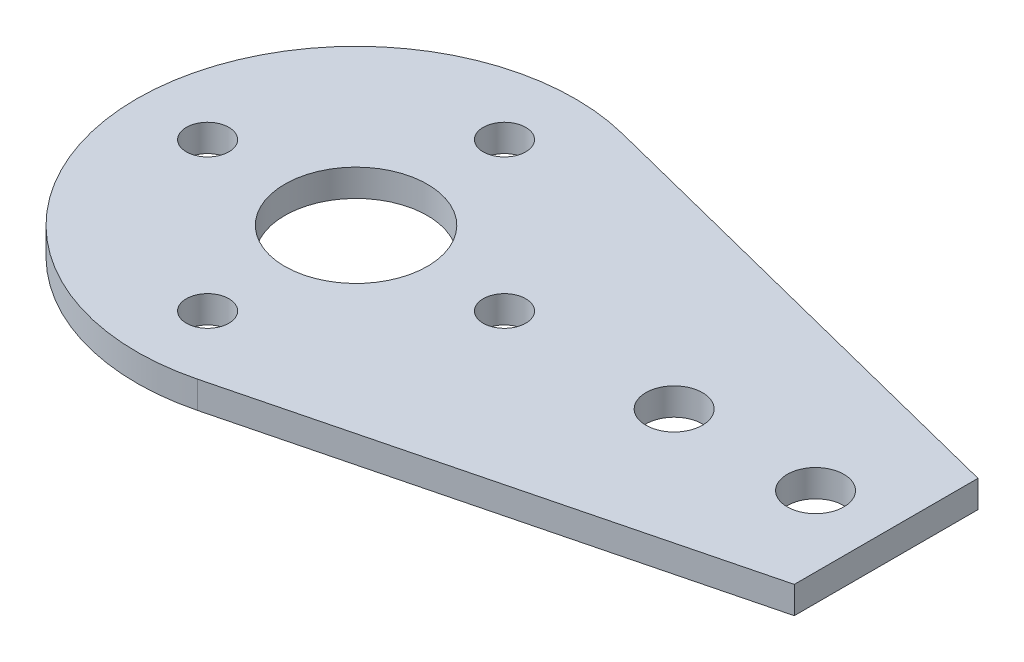
ISO-10303-21;
HEADER;
FILE_DESCRIPTION(('STEP AP214'),'2;1');
FILE_NAME('part.step','',(''),(''),'','','');
FILE_SCHEMA(('AUTOMOTIVE_DESIGN { 1 0 10303 214 1 1 1 1 }'));
ENDSEC;
DATA;
#1=APPLICATION_CONTEXT('core data for automotive mechanical design processes');
#2=APPLICATION_PROTOCOL_DEFINITION('international standard','automotive_design',2000,#1);
#3=PRODUCT_CONTEXT('',#1,'mechanical');
#4=PRODUCT('Part','Part','',(#3));
#5=PRODUCT_RELATED_PRODUCT_CATEGORY('part','',(#4));
#6=PRODUCT_DEFINITION_FORMATION('','',#4);
#7=PRODUCT_DEFINITION_CONTEXT('part definition',#1,'design');
#8=PRODUCT_DEFINITION('design','',#6,#7);
#9=PRODUCT_DEFINITION_SHAPE('','',#8);
#10=(LENGTH_UNIT() NAMED_UNIT(*) SI_UNIT(.MILLI.,.METRE.));
#11=(NAMED_UNIT(*) PLANE_ANGLE_UNIT() SI_UNIT($,.RADIAN.));
#12=(NAMED_UNIT(*) SI_UNIT($,.STERADIAN.) SOLID_ANGLE_UNIT());
#13=UNCERTAINTY_MEASURE_WITH_UNIT(LENGTH_MEASURE(1.E-05),#10,'distance_accuracy_value','');
#14=(GEOMETRIC_REPRESENTATION_CONTEXT(3) GLOBAL_UNCERTAINTY_ASSIGNED_CONTEXT((#13)) GLOBAL_UNIT_ASSIGNED_CONTEXT((#10,
#11,#12)) REPRESENTATION_CONTEXT('',''));
#15=CARTESIAN_POINT('',(0.,0.,0.));
#16=DIRECTION('',(0.,0.,1.));
#17=DIRECTION('',(1.,0.,0.));
#18=AXIS2_PLACEMENT_3D('',#15,#16,#17);
#19=CARTESIAN_POINT('',(0.,1.524,0.));
#20=DIRECTION('',(0.,1.,0.));
#21=DIRECTION('',(0.,0.,1.));
#22=AXIS2_PLACEMENT_3D('',#19,#20,#21);
#23=PLANE('',#22);
#24=CARTESIAN_POINT('',(0.,1.524,8.3312));
#25=DIRECTION('',(0.,1.,0.));
#26=DIRECTION('',(0.,0.,1.));
#27=AXIS2_PLACEMENT_3D('',#24,#25,#26);
#28=CIRCLE('',#27,1.1938);
#29=CARTESIAN_POINT('',(0.,1.524,9.525));
#30=VERTEX_POINT('',#29);
#31=EDGE_CURVE('E139',#30,#30,#28,.T.);
#32=ORIENTED_EDGE('',*,*,#31,.F.);
#33=EDGE_LOOP('',(#32));
#34=FACE_BOUND('',#33,.T.);
#35=CARTESIAN_POINT('',(0.,1.524,-8.3312));
#36=DIRECTION('',(0.,1.,0.));
#37=DIRECTION('',(0.,0.,1.));
#38=AXIS2_PLACEMENT_3D('',#35,#36,#37);
#39=CIRCLE('',#38,1.1938);
#40=CARTESIAN_POINT('',(0.,1.524,-7.1374));
#41=VERTEX_POINT('',#40);
#42=EDGE_CURVE('E127',#41,#41,#39,.T.);
#43=ORIENTED_EDGE('',*,*,#42,.F.);
#44=EDGE_LOOP('',(#43));
#45=FACE_BOUND('',#44,.T.);
#46=CARTESIAN_POINT('',(0.,1.524,0.));
#47=DIRECTION('',(0.,1.,0.));
#48=DIRECTION('',(0.,0.,1.));
#49=AXIS2_PLACEMENT_3D('',#46,#47,#48);
#50=CIRCLE('',#49,4.0005);
#51=CARTESIAN_POINT('',(0.,1.524,4.0005));
#52=VERTEX_POINT('',#51);
#53=EDGE_CURVE('E115',#52,#52,#50,.T.);
#54=ORIENTED_EDGE('',*,*,#53,.F.);
#55=EDGE_LOOP('',(#54));
#56=FACE_BOUND('',#55,.T.);
#57=DIRECTION('',(-0.969371885772066,0.,-0.245597530677141));
#58=VECTOR('',#57,1.);
#59=CARTESIAN_POINT('',(29.7561,1.524,-5.1562));
#60=LINE('',#59,#58);
#61=CARTESIAN_POINT('',(29.7561,1.524,-5.1562));
#62=VERTEX_POINT('',#61);
#63=CARTESIAN_POINT('',(3.0223968917721,1.524,-11.9293812378768));
#64=VERTEX_POINT('',#63);
#65=EDGE_CURVE('E85',#62,#64,#60,.T.);
#66=ORIENTED_EDGE('',*,*,#65,.T.);
#67=CARTESIAN_POINT('',(0.,1.524,0.));
#68=DIRECTION('',(0.,1.,0.));
#69=DIRECTION('',(0.,0.,1.));
#70=AXIS2_PLACEMENT_3D('',#67,#68,#69);
#71=CIRCLE('',#70,12.3063);
#72=CARTESIAN_POINT('',(3.0223968917721,1.524,11.9293812378768));
#73=VERTEX_POINT('',#72);
#74=EDGE_CURVE('E80',#64,#73,#71,.T.);
#75=ORIENTED_EDGE('',*,*,#74,.T.);
#76=DIRECTION('',(0.969371885772066,0.,-0.245597530677141));
#77=VECTOR('',#76,1.);
#78=CARTESIAN_POINT('',(29.7561,1.524,5.1562));
#79=LINE('',#78,#77);
#80=CARTESIAN_POINT('',(29.7561,1.524,5.1562));
#81=VERTEX_POINT('',#80);
#82=EDGE_CURVE('E83',#73,#81,#79,.T.);
#83=ORIENTED_EDGE('',*,*,#82,.T.);
#84=DIRECTION('',(0.,0.,-1.));
#85=VECTOR('',#84,1.);
#86=CARTESIAN_POINT('',(29.7561,1.524,-5.1562));
#87=LINE('',#86,#85);
#88=EDGE_CURVE('E50',#81,#62,#87,.T.);
#89=ORIENTED_EDGE('',*,*,#88,.T.);
#90=EDGE_LOOP('',(#66,#75,#83,#89));
#91=FACE_BOUND('',#90,.T.);
#92=CARTESIAN_POINT('',(25.7937,1.524,0.));
#93=DIRECTION('',(0.,1.,0.));
#94=DIRECTION('',(0.,0.,1.));
#95=AXIS2_PLACEMENT_3D('',#92,#93,#94);
#96=CIRCLE('',#95,1.5875);
#97=CARTESIAN_POINT('',(25.7937,1.524,1.5875));
#98=VERTEX_POINT('',#97);
#99=EDGE_CURVE('E100',#98,#98,#96,.T.);
#100=ORIENTED_EDGE('',*,*,#99,.F.);
#101=EDGE_LOOP('',(#100));
#102=FACE_BOUND('',#101,.T.);
#103=CARTESIAN_POINT('',(8.3312,1.524,0.));
#104=DIRECTION('',(0.,1.,0.));
#105=DIRECTION('',(0.,0.,1.));
#106=AXIS2_PLACEMENT_3D('',#103,#104,#105);
#107=CIRCLE('',#106,1.1938);
#108=CARTESIAN_POINT('',(8.3312,1.524,1.1938));
#109=VERTEX_POINT('',#108);
#110=EDGE_CURVE('E121',#109,#109,#107,.T.);
#111=ORIENTED_EDGE('',*,*,#110,.F.);
#112=EDGE_LOOP('',(#111));
#113=FACE_BOUND('',#112,.T.);
#114=CARTESIAN_POINT('',(-8.3312,1.524,0.));
#115=DIRECTION('',(0.,1.,0.));
#116=DIRECTION('',(0.,0.,1.));
#117=AXIS2_PLACEMENT_3D('',#114,#115,#116);
#118=CIRCLE('',#117,1.1938);
#119=CARTESIAN_POINT('',(-8.3312,1.524,1.1938));
#120=VERTEX_POINT('',#119);
#121=EDGE_CURVE('E133',#120,#120,#118,.T.);
#122=ORIENTED_EDGE('',*,*,#121,.F.);
#123=EDGE_LOOP('',(#122));
#124=FACE_BOUND('',#123,.T.);
#125=CARTESIAN_POINT('',(17.8562,1.524,0.));
#126=DIRECTION('',(0.,1.,0.));
#127=DIRECTION('',(0.,0.,1.));
#128=AXIS2_PLACEMENT_3D('',#125,#126,#127);
#129=CIRCLE('',#128,1.5875);
#130=CARTESIAN_POINT('',(17.8562,1.524,1.5875));
#131=VERTEX_POINT('',#130);
#132=EDGE_CURVE('E145',#131,#131,#129,.T.);
#133=ORIENTED_EDGE('',*,*,#132,.F.);
#134=EDGE_LOOP('',(#133));
#135=FACE_BOUND('',#134,.T.);
#136=ADVANCED_FACE('F33',(#34,#45,#56,#91,#102,#113,#124,#135),#23,.T.);
#137=CARTESIAN_POINT('',(0.,0.,0.));
#138=DIRECTION('',(0.,1.,0.));
#139=DIRECTION('',(0.,0.,1.));
#140=AXIS2_PLACEMENT_3D('',#137,#138,#139);
#141=PLANE('',#140);
#142=CARTESIAN_POINT('',(0.,0.,8.3312));
#143=DIRECTION('',(0.,1.,0.));
#144=DIRECTION('',(0.,0.,1.));
#145=AXIS2_PLACEMENT_3D('',#142,#143,#144);
#146=CIRCLE('',#145,1.1938);
#147=CARTESIAN_POINT('',(0.,0.,9.525));
#148=VERTEX_POINT('',#147);
#149=EDGE_CURVE('E142',#148,#148,#146,.T.);
#150=ORIENTED_EDGE('',*,*,#149,.T.);
#151=EDGE_LOOP('',(#150));
#152=FACE_BOUND('',#151,.T.);
#153=CARTESIAN_POINT('',(0.,0.,-8.3312));
#154=DIRECTION('',(0.,1.,0.));
#155=DIRECTION('',(0.,0.,1.));
#156=AXIS2_PLACEMENT_3D('',#153,#154,#155);
#157=CIRCLE('',#156,1.1938);
#158=CARTESIAN_POINT('',(0.,0.,-7.1374));
#159=VERTEX_POINT('',#158);
#160=EDGE_CURVE('E130',#159,#159,#157,.T.);
#161=ORIENTED_EDGE('',*,*,#160,.T.);
#162=EDGE_LOOP('',(#161));
#163=FACE_BOUND('',#162,.T.);
#164=CARTESIAN_POINT('',(0.,0.,0.));
#165=DIRECTION('',(0.,1.,0.));
#166=DIRECTION('',(0.,0.,1.));
#167=AXIS2_PLACEMENT_3D('',#164,#165,#166);
#168=CIRCLE('',#167,4.0005);
#169=CARTESIAN_POINT('',(0.,0.,4.0005));
#170=VERTEX_POINT('',#169);
#171=EDGE_CURVE('E118',#170,#170,#168,.T.);
#172=ORIENTED_EDGE('',*,*,#171,.T.);
#173=EDGE_LOOP('',(#172));
#174=FACE_BOUND('',#173,.T.);
#175=DIRECTION('',(-0.969371885772066,0.,-0.245597530677141));
#176=VECTOR('',#175,1.);
#177=CARTESIAN_POINT('',(29.7561,0.,-5.1562));
#178=LINE('',#177,#176);
#179=CARTESIAN_POINT('',(29.7561,0.,-5.1562));
#180=VERTEX_POINT('',#179);
#181=CARTESIAN_POINT('',(3.0223968917721,0.,-11.9293812378768));
#182=VERTEX_POINT('',#181);
#183=EDGE_CURVE('E97',#180,#182,#178,.T.);
#184=ORIENTED_EDGE('',*,*,#183,.F.);
#185=DIRECTION('',(0.,0.,-1.));
#186=VECTOR('',#185,1.);
#187=CARTESIAN_POINT('',(29.7561,0.,-5.1562));
#188=LINE('',#187,#186);
#189=CARTESIAN_POINT('',(29.7561,0.,5.1562));
#190=VERTEX_POINT('',#189);
#191=EDGE_CURVE('E73',#190,#180,#188,.T.);
#192=ORIENTED_EDGE('',*,*,#191,.F.);
#193=DIRECTION('',(0.969371885772066,0.,-0.245597530677141));
#194=VECTOR('',#193,1.);
#195=CARTESIAN_POINT('',(29.7561,0.,5.1562));
#196=LINE('',#195,#194);
#197=CARTESIAN_POINT('',(3.0223968917721,0.,11.9293812378768));
#198=VERTEX_POINT('',#197);
#199=EDGE_CURVE('E67',#198,#190,#196,.T.);
#200=ORIENTED_EDGE('',*,*,#199,.F.);
#201=CARTESIAN_POINT('',(0.,0.,0.));
#202=DIRECTION('',(0.,1.,0.));
#203=DIRECTION('',(0.,0.,1.));
#204=AXIS2_PLACEMENT_3D('',#201,#202,#203);
#205=CIRCLE('',#204,12.3063);
#206=EDGE_CURVE('E89',#182,#198,#205,.T.);
#207=ORIENTED_EDGE('',*,*,#206,.F.);
#208=EDGE_LOOP('',(#184,#192,#200,#207));
#209=FACE_BOUND('',#208,.T.);
#210=CARTESIAN_POINT('',(25.7937,0.,0.));
#211=DIRECTION('',(0.,1.,0.));
#212=DIRECTION('',(0.,0.,1.));
#213=AXIS2_PLACEMENT_3D('',#210,#211,#212);
#214=CIRCLE('',#213,1.5875);
#215=CARTESIAN_POINT('',(25.7937,0.,1.5875));
#216=VERTEX_POINT('',#215);
#217=EDGE_CURVE('E112',#216,#216,#214,.T.);
#218=ORIENTED_EDGE('',*,*,#217,.T.);
#219=EDGE_LOOP('',(#218));
#220=FACE_BOUND('',#219,.T.);
#221=CARTESIAN_POINT('',(8.3312,0.,0.));
#222=DIRECTION('',(0.,1.,0.));
#223=DIRECTION('',(0.,0.,1.));
#224=AXIS2_PLACEMENT_3D('',#221,#222,#223);
#225=CIRCLE('',#224,1.1938);
#226=CARTESIAN_POINT('',(8.3312,0.,1.1938));
#227=VERTEX_POINT('',#226);
#228=EDGE_CURVE('E124',#227,#227,#225,.T.);
#229=ORIENTED_EDGE('',*,*,#228,.T.);
#230=EDGE_LOOP('',(#229));
#231=FACE_BOUND('',#230,.T.);
#232=CARTESIAN_POINT('',(-8.3312,0.,0.));
#233=DIRECTION('',(0.,1.,0.));
#234=DIRECTION('',(0.,0.,1.));
#235=AXIS2_PLACEMENT_3D('',#232,#233,#234);
#236=CIRCLE('',#235,1.1938);
#237=CARTESIAN_POINT('',(-8.3312,0.,1.1938));
#238=VERTEX_POINT('',#237);
#239=EDGE_CURVE('E136',#238,#238,#236,.T.);
#240=ORIENTED_EDGE('',*,*,#239,.T.);
#241=EDGE_LOOP('',(#240));
#242=FACE_BOUND('',#241,.T.);
#243=CARTESIAN_POINT('',(17.8562,0.,0.));
#244=DIRECTION('',(0.,1.,0.));
#245=DIRECTION('',(0.,0.,1.));
#246=AXIS2_PLACEMENT_3D('',#243,#244,#245);
#247=CIRCLE('',#246,1.5875);
#248=CARTESIAN_POINT('',(17.8562,0.,1.5875));
#249=VERTEX_POINT('',#248);
#250=EDGE_CURVE('E148',#249,#249,#247,.T.);
#251=ORIENTED_EDGE('',*,*,#250,.T.);
#252=EDGE_LOOP('',(#251));
#253=FACE_BOUND('',#252,.T.);
#254=ADVANCED_FACE('F108',(#152,#163,#174,#209,#220,#231,#242,#253),#141,.F.);
#255=CARTESIAN_POINT('',(29.7561,1.524,-5.1562));
#256=DIRECTION('',(-0.245597530677141,0.,0.969371885772066));
#257=DIRECTION('',(0.969371885772066,0.,0.245597530677141));
#258=AXIS2_PLACEMENT_3D('',#255,#256,#257);
#259=PLANE('',#258);
#260=ORIENTED_EDGE('',*,*,#183,.T.);
#261=DIRECTION('',(0.,-1.,0.));
#262=VECTOR('',#261,1.);
#263=CARTESIAN_POINT('',(3.0223968917721,1.524,-11.9293812378768));
#264=LINE('',#263,#262);
#265=EDGE_CURVE('E11',#64,#182,#264,.T.);
#266=ORIENTED_EDGE('',*,*,#265,.F.);
#267=ORIENTED_EDGE('',*,*,#65,.F.);
#268=DIRECTION('',(0.,-1.,0.));
#269=VECTOR('',#268,1.);
#270=CARTESIAN_POINT('',(29.7561,1.524,-5.1562));
#271=LINE('',#270,#269);
#272=EDGE_CURVE('E93',#62,#180,#271,.T.);
#273=ORIENTED_EDGE('',*,*,#272,.T.);
#274=EDGE_LOOP('',(#260,#266,#267,#273));
#275=FACE_BOUND('',#274,.T.);
#276=ADVANCED_FACE('F35',(#275),#259,.F.);
#277=CARTESIAN_POINT('',(0.,1.524,0.));
#278=DIRECTION('',(0.,-1.,0.));
#279=DIRECTION('',(0.,0.,-1.));
#280=AXIS2_PLACEMENT_3D('',#277,#278,#279);
#281=CYLINDRICAL_SURFACE('',#280,12.3063);
#282=ORIENTED_EDGE('',*,*,#206,.T.);
#283=DIRECTION('',(0.,-1.,0.));
#284=VECTOR('',#283,1.);
#285=CARTESIAN_POINT('',(3.0223968917721,1.524,11.9293812378768));
#286=LINE('',#285,#284);
#287=EDGE_CURVE('E42',#73,#198,#286,.T.);
#288=ORIENTED_EDGE('',*,*,#287,.F.);
#289=ORIENTED_EDGE('',*,*,#74,.F.);
#290=ORIENTED_EDGE('',*,*,#265,.T.);
#291=EDGE_LOOP('',(#282,#288,#289,#290));
#292=FACE_BOUND('',#291,.T.);
#293=ADVANCED_FACE('F88',(#292),#281,.T.);
#294=CARTESIAN_POINT('',(29.7561,1.524,5.1562));
#295=DIRECTION('',(-0.245597530677141,0.,-0.969371885772066));
#296=DIRECTION('',(-0.969371885772066,0.,0.245597530677141));
#297=AXIS2_PLACEMENT_3D('',#294,#295,#296);
#298=PLANE('',#297);
#299=ORIENTED_EDGE('',*,*,#199,.T.);
#300=DIRECTION('',(0.,-1.,0.));
#301=VECTOR('',#300,1.);
#302=CARTESIAN_POINT('',(29.7561,1.524,5.1562));
#303=LINE('',#302,#301);
#304=EDGE_CURVE('E90',#81,#190,#303,.T.);
#305=ORIENTED_EDGE('',*,*,#304,.F.);
#306=ORIENTED_EDGE('',*,*,#82,.F.);
#307=ORIENTED_EDGE('',*,*,#287,.T.);
#308=EDGE_LOOP('',(#299,#305,#306,#307));
#309=FACE_BOUND('',#308,.T.);
#310=ADVANCED_FACE('F91',(#309),#298,.F.);
#311=CARTESIAN_POINT('',(29.7561,1.524,-5.1562));
#312=DIRECTION('',(-1.,0.,0.));
#313=DIRECTION('',(0.,0.,1.));
#314=AXIS2_PLACEMENT_3D('',#311,#312,#313);
#315=PLANE('',#314);
#316=ORIENTED_EDGE('',*,*,#191,.T.);
#317=ORIENTED_EDGE('',*,*,#272,.F.);
#318=ORIENTED_EDGE('',*,*,#88,.F.);
#319=ORIENTED_EDGE('',*,*,#304,.T.);
#320=EDGE_LOOP('',(#316,#317,#318,#319));
#321=FACE_BOUND('',#320,.T.);
#322=ADVANCED_FACE('F105',(#321),#315,.F.);
#323=CARTESIAN_POINT('',(25.7937,1.524,0.));
#324=DIRECTION('',(0.,-1.,0.));
#325=DIRECTION('',(0.,0.,-1.));
#326=AXIS2_PLACEMENT_3D('',#323,#324,#325);
#327=CYLINDRICAL_SURFACE('',#326,1.5875);
#328=ORIENTED_EDGE('',*,*,#99,.T.);
#329=EDGE_LOOP('',(#328));
#330=FACE_BOUND('',#329,.T.);
#331=ORIENTED_EDGE('',*,*,#217,.F.);
#332=EDGE_LOOP('',(#331));
#333=FACE_BOUND('',#332,.T.);
#334=ADVANCED_FACE('F168',(#330,#333),#327,.F.);
#335=CARTESIAN_POINT('',(0.,1.524,0.));
#336=DIRECTION('',(0.,-1.,0.));
#337=DIRECTION('',(0.,0.,-1.));
#338=AXIS2_PLACEMENT_3D('',#335,#336,#337);
#339=CYLINDRICAL_SURFACE('',#338,4.0005);
#340=ORIENTED_EDGE('',*,*,#53,.T.);
#341=EDGE_LOOP('',(#340));
#342=FACE_BOUND('',#341,.T.);
#343=ORIENTED_EDGE('',*,*,#171,.F.);
#344=EDGE_LOOP('',(#343));
#345=FACE_BOUND('',#344,.T.);
#346=ADVANCED_FACE('F222',(#342,#345),#339,.F.);
#347=CARTESIAN_POINT('',(8.3312,1.524,0.));
#348=DIRECTION('',(0.,-1.,0.));
#349=DIRECTION('',(0.,0.,-1.));
#350=AXIS2_PLACEMENT_3D('',#347,#348,#349);
#351=CYLINDRICAL_SURFACE('',#350,1.1938);
#352=ORIENTED_EDGE('',*,*,#110,.T.);
#353=EDGE_LOOP('',(#352));
#354=FACE_BOUND('',#353,.T.);
#355=ORIENTED_EDGE('',*,*,#228,.F.);
#356=EDGE_LOOP('',(#355));
#357=FACE_BOUND('',#356,.T.);
#358=ADVANCED_FACE('F231',(#354,#357),#351,.F.);
#359=CARTESIAN_POINT('',(0.,1.524,-8.3312));
#360=DIRECTION('',(0.,-1.,0.));
#361=DIRECTION('',(0.,0.,-1.));
#362=AXIS2_PLACEMENT_3D('',#359,#360,#361);
#363=CYLINDRICAL_SURFACE('',#362,1.1938);
#364=ORIENTED_EDGE('',*,*,#42,.T.);
#365=EDGE_LOOP('',(#364));
#366=FACE_BOUND('',#365,.T.);
#367=ORIENTED_EDGE('',*,*,#160,.F.);
#368=EDGE_LOOP('',(#367));
#369=FACE_BOUND('',#368,.T.);
#370=ADVANCED_FACE('F240',(#366,#369),#363,.F.);
#371=CARTESIAN_POINT('',(-8.3312,1.524,0.));
#372=DIRECTION('',(0.,-1.,0.));
#373=DIRECTION('',(0.,0.,-1.));
#374=AXIS2_PLACEMENT_3D('',#371,#372,#373);
#375=CYLINDRICAL_SURFACE('',#374,1.1938);
#376=ORIENTED_EDGE('',*,*,#121,.T.);
#377=EDGE_LOOP('',(#376));
#378=FACE_BOUND('',#377,.T.);
#379=ORIENTED_EDGE('',*,*,#239,.F.);
#380=EDGE_LOOP('',(#379));
#381=FACE_BOUND('',#380,.T.);
#382=ADVANCED_FACE('F250',(#378,#381),#375,.F.);
#383=CARTESIAN_POINT('',(0.,1.524,8.3312));
#384=DIRECTION('',(0.,-1.,0.));
#385=DIRECTION('',(0.,0.,-1.));
#386=AXIS2_PLACEMENT_3D('',#383,#384,#385);
#387=CYLINDRICAL_SURFACE('',#386,1.1938);
#388=ORIENTED_EDGE('',*,*,#31,.T.);
#389=EDGE_LOOP('',(#388));
#390=FACE_BOUND('',#389,.T.);
#391=ORIENTED_EDGE('',*,*,#149,.F.);
#392=EDGE_LOOP('',(#391));
#393=FACE_BOUND('',#392,.T.);
#394=ADVANCED_FACE('F260',(#390,#393),#387,.F.);
#395=CARTESIAN_POINT('',(17.8562,1.524,0.));
#396=DIRECTION('',(0.,-1.,0.));
#397=DIRECTION('',(0.,0.,-1.));
#398=AXIS2_PLACEMENT_3D('',#395,#396,#397);
#399=CYLINDRICAL_SURFACE('',#398,1.5875);
#400=ORIENTED_EDGE('',*,*,#132,.T.);
#401=EDGE_LOOP('',(#400));
#402=FACE_BOUND('',#401,.T.);
#403=ORIENTED_EDGE('',*,*,#250,.F.);
#404=EDGE_LOOP('',(#403));
#405=FACE_BOUND('',#404,.T.);
#406=ADVANCED_FACE('F154',(#402,#405),#399,.F.);
#407=CLOSED_SHELL('',(#136,#254,#276,#293,#310,#322,#334,#346,#358,#370,#382,#394,#406));
#408=MANIFOLD_SOLID_BREP('B2',#407);
#409=ADVANCED_BREP_SHAPE_REPRESENTATION('',(#18,#408),#14);
#410=SHAPE_DEFINITION_REPRESENTATION(#9,#409);
ENDSEC;
END-ISO-10303-21;
